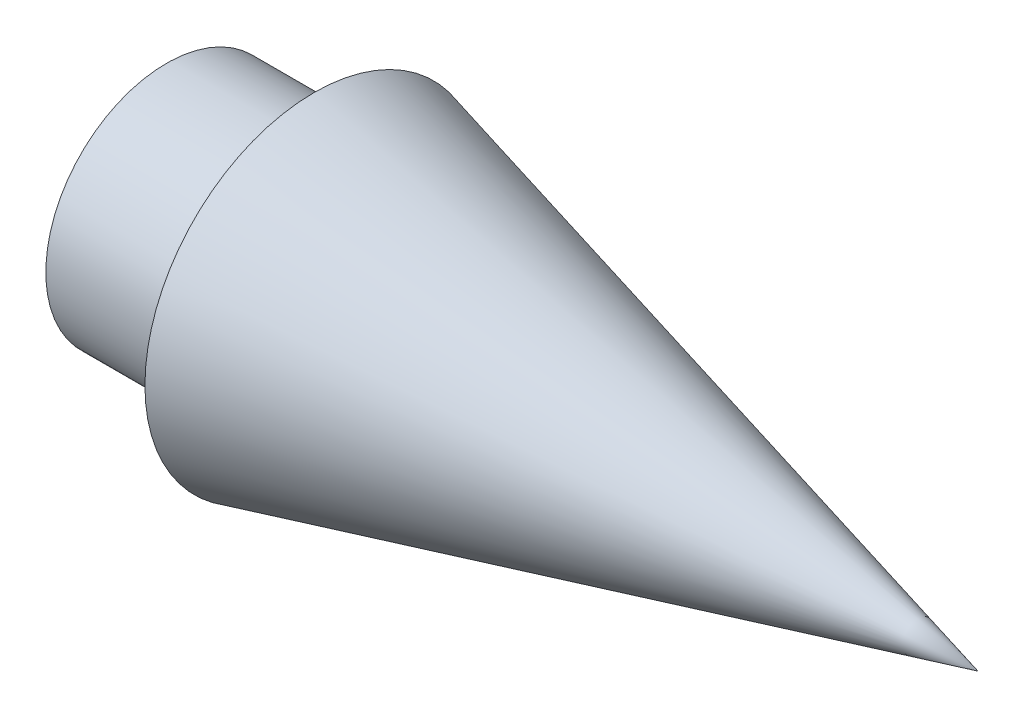
ISO-10303-21;
HEADER;
FILE_DESCRIPTION(('STEP AP214'),'2;1');
FILE_NAME('part.step','',(''),(''),'','','');
FILE_SCHEMA(('AUTOMOTIVE_DESIGN { 1 0 10303 214 1 1 1 1 }'));
ENDSEC;
DATA;
#1=APPLICATION_CONTEXT('core data for automotive mechanical design processes');
#2=APPLICATION_PROTOCOL_DEFINITION('international standard','automotive_design',2000,#1);
#3=PRODUCT_CONTEXT('',#1,'mechanical');
#4=PRODUCT('Part','Part','',(#3));
#5=PRODUCT_RELATED_PRODUCT_CATEGORY('part','',(#4));
#6=PRODUCT_DEFINITION_FORMATION('','',#4);
#7=PRODUCT_DEFINITION_CONTEXT('part definition',#1,'design');
#8=PRODUCT_DEFINITION('design','',#6,#7);
#9=PRODUCT_DEFINITION_SHAPE('','',#8);
#10=(LENGTH_UNIT() NAMED_UNIT(*) SI_UNIT(.MILLI.,.METRE.));
#11=(NAMED_UNIT(*) PLANE_ANGLE_UNIT() SI_UNIT($,.RADIAN.));
#12=(NAMED_UNIT(*) SI_UNIT($,.STERADIAN.) SOLID_ANGLE_UNIT());
#13=UNCERTAINTY_MEASURE_WITH_UNIT(LENGTH_MEASURE(1.E-05),#10,'distance_accuracy_value','');
#14=(GEOMETRIC_REPRESENTATION_CONTEXT(3) GLOBAL_UNCERTAINTY_ASSIGNED_CONTEXT((#13)) GLOBAL_UNIT_ASSIGNED_CONTEXT((#10,
#11,#12)) REPRESENTATION_CONTEXT('',''));
#15=CARTESIAN_POINT('',(0.,0.,0.));
#16=DIRECTION('',(0.,0.,1.));
#17=DIRECTION('',(1.,0.,0.));
#18=AXIS2_PLACEMENT_3D('',#15,#16,#17);
#19=CARTESIAN_POINT('',(-12.7,0.,0.));
#20=DIRECTION('',(-1.,0.,0.));
#21=DIRECTION('',(0.,0.,1.));
#22=AXIS2_PLACEMENT_3D('',#19,#20,#21);
#23=PLANE('',#22);
#24=CARTESIAN_POINT('',(-12.7,0.,0.));
#25=DIRECTION('',(-1.,0.,0.));
#26=DIRECTION('',(0.,0.,1.));
#27=AXIS2_PLACEMENT_3D('',#24,#25,#26);
#28=CIRCLE('',#27,2.55269999999999);
#29=CARTESIAN_POINT('',(-12.7,0.,2.55269999999999));
#30=VERTEX_POINT('',#29);
#31=EDGE_CURVE('E77',#30,#30,#28,.T.);
#32=ORIENTED_EDGE('',*,*,#31,.F.);
#33=EDGE_LOOP('',(#32));
#34=FACE_BOUND('',#33,.T.);
#35=CARTESIAN_POINT('',(-12.7,0.,0.));
#36=DIRECTION('',(1.,0.,0.));
#37=DIRECTION('',(0.,0.,-1.));
#38=AXIS2_PLACEMENT_3D('',#35,#36,#37);
#39=CIRCLE('',#38,10.3886);
#40=CARTESIAN_POINT('',(-12.7,0.,-10.3886));
#41=VERTEX_POINT('',#40);
#42=EDGE_CURVE('E11',#41,#41,#39,.T.);
#43=ORIENTED_EDGE('',*,*,#42,.F.);
#44=EDGE_LOOP('',(#43));
#45=FACE_BOUND('',#44,.T.);
#46=ADVANCED_FACE('F53',(#34,#45),#23,.T.);
#47=CARTESIAN_POINT('',(57.15,0.,0.));
#48=DIRECTION('',(1.,0.,0.));
#49=DIRECTION('',(0.,0.,-1.));
#50=AXIS2_PLACEMENT_3D('',#47,#48,#49);
#51=CYLINDRICAL_SURFACE('',#50,10.3886);
#52=ORIENTED_EDGE('',*,*,#42,.T.);
#53=EDGE_LOOP('',(#52));
#54=FACE_BOUND('',#53,.T.);
#55=CARTESIAN_POINT('',(0.,0.,0.));
#56=DIRECTION('',(1.,0.,0.));
#57=DIRECTION('',(0.,0.,-1.));
#58=AXIS2_PLACEMENT_3D('',#55,#56,#57);
#59=CIRCLE('',#58,10.3886);
#60=CARTESIAN_POINT('',(0.,0.,-10.3886));
#61=VERTEX_POINT('',#60);
#62=EDGE_CURVE('E60',#61,#61,#59,.T.);
#63=ORIENTED_EDGE('',*,*,#62,.F.);
#64=EDGE_LOOP('',(#63));
#65=FACE_BOUND('',#64,.T.);
#66=ADVANCED_FACE('F89',(#54,#65),#51,.T.);
#67=CARTESIAN_POINT('',(0.,0.,-10.3886));
#68=DIRECTION('',(-1.,0.,0.));
#69=DIRECTION('',(0.,0.,1.));
#70=AXIS2_PLACEMENT_3D('',#67,#68,#69);
#71=PLANE('',#70);
#72=ORIENTED_EDGE('',*,*,#62,.T.);
#73=EDGE_LOOP('',(#72));
#74=FACE_BOUND('',#73,.T.);
#75=CARTESIAN_POINT('',(0.,0.,0.));
#76=DIRECTION('',(1.,0.,0.));
#77=DIRECTION('',(0.,0.,-1.));
#78=AXIS2_PLACEMENT_3D('',#75,#76,#77);
#79=CIRCLE('',#78,14.557883);
#80=CARTESIAN_POINT('',(0.,0.,-14.557883));
#81=VERTEX_POINT('',#80);
#82=EDGE_CURVE('E76',#81,#81,#79,.T.);
#83=ORIENTED_EDGE('',*,*,#82,.F.);
#84=EDGE_LOOP('',(#83));
#85=FACE_BOUND('',#84,.T.);
#86=ADVANCED_FACE('F86',(#74,#85),#71,.T.);
#87=CARTESIAN_POINT('',(57.15,0.,0.));
#88=DIRECTION('',(-1.,0.,0.));
#89=DIRECTION('',(0.,0.,1.));
#90=AXIS2_PLACEMENT_3D('',#87,#88,#89);
#91=CONICAL_SURFACE('',#90,0.,0.249426492885029);
#92=ORIENTED_EDGE('',*,*,#82,.T.);
#93=EDGE_LOOP('',(#92));
#94=FACE_BOUND('',#93,.T.);
#95=CARTESIAN_POINT('',(57.15,0.,0.));
#96=VERTEX_POINT('',#95);
#97=VERTEX_LOOP('',#96);
#98=FACE_BOUND('',#97,.T.);
#99=ADVANCED_FACE('F70',(#94,#98),#91,.T.);
#100=CARTESIAN_POINT('',(6.35,0.,0.));
#101=DIRECTION('',(-1.,0.,0.));
#102=DIRECTION('',(0.,0.,1.));
#103=AXIS2_PLACEMENT_3D('',#100,#101,#102);
#104=CONICAL_SURFACE('',#103,2.55269999999999,1.02974425867665);
#105=CARTESIAN_POINT('',(7.88381690219165,0.,0.));
#106=VERTEX_POINT('',#105);
#107=VERTEX_LOOP('',#106);
#108=FACE_BOUND('',#107,.T.);
#109=CARTESIAN_POINT('',(6.35,0.,0.));
#110=DIRECTION('',(-1.,0.,0.));
#111=DIRECTION('',(0.,0.,1.));
#112=AXIS2_PLACEMENT_3D('',#109,#110,#111);
#113=CIRCLE('',#112,2.55269999999999);
#114=CARTESIAN_POINT('',(6.35,0.,2.55269999999999));
#115=VERTEX_POINT('',#114);
#116=EDGE_CURVE('E74',#115,#115,#113,.T.);
#117=ORIENTED_EDGE('',*,*,#116,.T.);
#118=EDGE_LOOP('',(#117));
#119=FACE_BOUND('',#118,.T.);
#120=ADVANCED_FACE('F66',(#108,#119),#104,.F.);
#121=CARTESIAN_POINT('',(-12.7,0.,0.));
#122=DIRECTION('',(-1.,0.,0.));
#123=DIRECTION('',(0.,0.,1.));
#124=AXIS2_PLACEMENT_3D('',#121,#122,#123);
#125=CYLINDRICAL_SURFACE('',#124,2.55269999999999);
#126=ORIENTED_EDGE('',*,*,#116,.F.);
#127=EDGE_LOOP('',(#126));
#128=FACE_BOUND('',#127,.T.);
#129=ORIENTED_EDGE('',*,*,#31,.T.);
#130=EDGE_LOOP('',(#129));
#131=FACE_BOUND('',#130,.T.);
#132=ADVANCED_FACE('F69',(#128,#131),#125,.F.);
#133=CLOSED_SHELL('',(#46,#66,#86,#99,#120,#132));
#134=MANIFOLD_SOLID_BREP('B2',#133);
#135=ADVANCED_BREP_SHAPE_REPRESENTATION('',(#18,#134),#14);
#136=SHAPE_DEFINITION_REPRESENTATION(#9,#135);
ENDSEC;
END-ISO-10303-21;
